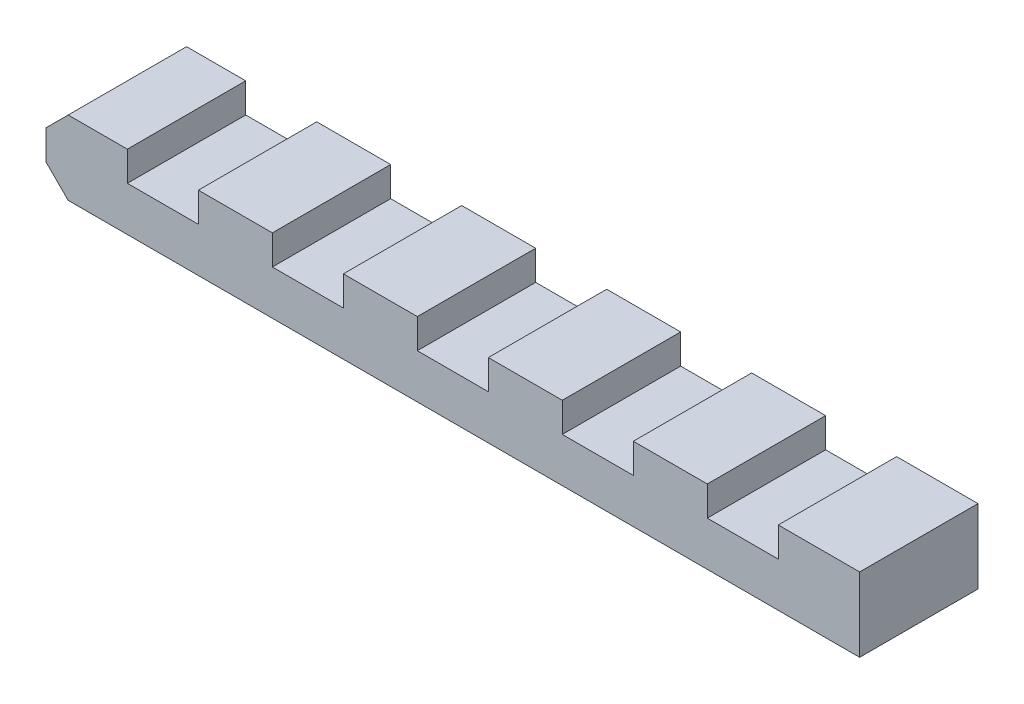
ISO-10303-21;
HEADER;
FILE_DESCRIPTION(('STEP AP214'),'2;1');
FILE_NAME('part.step','',(''),(''),'','','');
FILE_SCHEMA(('AUTOMOTIVE_DESIGN { 1 0 10303 214 1 1 1 1 }'));
ENDSEC;
DATA;
#1=APPLICATION_CONTEXT('core data for automotive mechanical design processes');
#2=APPLICATION_PROTOCOL_DEFINITION('international standard','automotive_design',2000,#1);
#3=PRODUCT_CONTEXT('',#1,'mechanical');
#4=PRODUCT('Part','Part','',(#3));
#5=PRODUCT_RELATED_PRODUCT_CATEGORY('part','',(#4));
#6=PRODUCT_DEFINITION_FORMATION('','',#4);
#7=PRODUCT_DEFINITION_CONTEXT('part definition',#1,'design');
#8=PRODUCT_DEFINITION('design','',#6,#7);
#9=PRODUCT_DEFINITION_SHAPE('','',#8);
#10=(LENGTH_UNIT() NAMED_UNIT(*) SI_UNIT(.MILLI.,.METRE.));
#11=(NAMED_UNIT(*) PLANE_ANGLE_UNIT() SI_UNIT($,.RADIAN.));
#12=(NAMED_UNIT(*) SI_UNIT($,.STERADIAN.) SOLID_ANGLE_UNIT());
#13=UNCERTAINTY_MEASURE_WITH_UNIT(LENGTH_MEASURE(1.E-05),#10,'distance_accuracy_value','');
#14=(GEOMETRIC_REPRESENTATION_CONTEXT(3) GLOBAL_UNCERTAINTY_ASSIGNED_CONTEXT((#13)) GLOBAL_UNIT_ASSIGNED_CONTEXT((#10,
#11,#12)) REPRESENTATION_CONTEXT('',''));
#15=CARTESIAN_POINT('',(0.,0.,0.));
#16=DIRECTION('',(0.,0.,1.));
#17=DIRECTION('',(1.,0.,0.));
#18=AXIS2_PLACEMENT_3D('',#15,#16,#17);
#19=CARTESIAN_POINT('',(0.,5.,0.));
#20=DIRECTION('',(0.,-1.,0.));
#21=DIRECTION('',(0.,0.,-1.));
#22=AXIS2_PLACEMENT_3D('',#19,#20,#21);
#23=PLANE('',#22);
#24=DIRECTION('',(-1.,0.,0.));
#25=VECTOR('',#24,1.);
#26=CARTESIAN_POINT('',(-27.5,5.,-4.));
#27=LINE('',#26,#25);
#28=CARTESIAN_POINT('',(-22.,5.,-4.));
#29=VERTEX_POINT('',#28);
#30=CARTESIAN_POINT('',(-26.,5.,-4.));
#31=VERTEX_POINT('',#30);
#32=EDGE_CURVE('E245',#29,#31,#27,.T.);
#33=ORIENTED_EDGE('',*,*,#32,.T.);
#34=DIRECTION('',(0.,0.,1.));
#35=VECTOR('',#34,1.);
#36=CARTESIAN_POINT('',(-26.,5.,0.));
#37=LINE('',#36,#35);
#38=CARTESIAN_POINT('',(-26.,5.,4.));
#39=VERTEX_POINT('',#38);
#40=EDGE_CURVE('E11',#31,#39,#37,.T.);
#41=ORIENTED_EDGE('',*,*,#40,.T.);
#42=DIRECTION('',(1.,0.,0.));
#43=VECTOR('',#42,1.);
#44=CARTESIAN_POINT('',(-27.5,5.,4.));
#45=LINE('',#44,#43);
#46=CARTESIAN_POINT('',(-22.,5.,4.));
#47=VERTEX_POINT('',#46);
#48=EDGE_CURVE('E424',#39,#47,#45,.T.);
#49=ORIENTED_EDGE('',*,*,#48,.T.);
#50=DIRECTION('',(0.,0.,1.));
#51=VECTOR('',#50,1.);
#52=CARTESIAN_POINT('',(-22.,5.,-4.));
#53=LINE('',#52,#51);
#54=EDGE_CURVE('E260',#29,#47,#53,.T.);
#55=ORIENTED_EDGE('',*,*,#54,.F.);
#56=EDGE_LOOP('',(#33,#41,#49,#55));
#57=FACE_BOUND('',#56,.T.);
#58=ADVANCED_FACE('F44',(#57),#23,.F.);
#59=CARTESIAN_POINT('',(-2.4,5.,-4.));
#60=VERTEX_POINT('',#59);
#61=CARTESIAN_POINT('',(-7.4,5.,-4.));
#62=VERTEX_POINT('',#61);
#63=EDGE_CURVE('E526',#60,#62,#27,.T.);
#64=ORIENTED_EDGE('',*,*,#63,.T.);
#65=DIRECTION('',(0.,0.,1.));
#66=VECTOR('',#65,1.);
#67=CARTESIAN_POINT('',(-7.4,5.,-4.));
#68=LINE('',#67,#66);
#69=CARTESIAN_POINT('',(-7.4,5.,4.));
#70=VERTEX_POINT('',#69);
#71=EDGE_CURVE('E280',#62,#70,#68,.T.);
#72=ORIENTED_EDGE('',*,*,#71,.T.);
#73=CARTESIAN_POINT('',(-2.4,5.,4.));
#74=VERTEX_POINT('',#73);
#75=EDGE_CURVE('E500',#70,#74,#45,.T.);
#76=ORIENTED_EDGE('',*,*,#75,.T.);
#77=DIRECTION('',(0.,0.,1.));
#78=VECTOR('',#77,1.);
#79=CARTESIAN_POINT('',(-2.4,5.,-4.));
#80=LINE('',#79,#78);
#81=EDGE_CURVE('E306',#60,#74,#80,.T.);
#82=ORIENTED_EDGE('',*,*,#81,.F.);
#83=EDGE_LOOP('',(#64,#72,#76,#82));
#84=FACE_BOUND('',#83,.T.);
#85=ADVANCED_FACE('F540',(#84),#23,.F.);
#86=CARTESIAN_POINT('',(7.4,5.,-4.));
#87=VERTEX_POINT('',#86);
#88=CARTESIAN_POINT('',(2.4,5.,-4.));
#89=VERTEX_POINT('',#88);
#90=EDGE_CURVE('E530',#87,#89,#27,.T.);
#91=ORIENTED_EDGE('',*,*,#90,.T.);
#92=DIRECTION('',(0.,0.,1.));
#93=VECTOR('',#92,1.);
#94=CARTESIAN_POINT('',(2.4,5.,-4.));
#95=LINE('',#94,#93);
#96=CARTESIAN_POINT('',(2.4,5.,4.));
#97=VERTEX_POINT('',#96);
#98=EDGE_CURVE('E316',#89,#97,#95,.T.);
#99=ORIENTED_EDGE('',*,*,#98,.T.);
#100=CARTESIAN_POINT('',(7.4,5.,4.));
#101=VERTEX_POINT('',#100);
#102=EDGE_CURVE('E494',#97,#101,#45,.T.);
#103=ORIENTED_EDGE('',*,*,#102,.T.);
#104=DIRECTION('',(0.,0.,1.));
#105=VECTOR('',#104,1.);
#106=CARTESIAN_POINT('',(7.4,5.,-4.));
#107=LINE('',#106,#105);
#108=EDGE_CURVE('E342',#87,#101,#107,.T.);
#109=ORIENTED_EDGE('',*,*,#108,.F.);
#110=EDGE_LOOP('',(#91,#99,#103,#109));
#111=FACE_BOUND('',#110,.T.);
#112=ADVANCED_FACE('F547',(#111),#23,.F.);
#113=CARTESIAN_POINT('',(17.2,5.,-4.));
#114=VERTEX_POINT('',#113);
#115=CARTESIAN_POINT('',(12.2,5.,-4.));
#116=VERTEX_POINT('',#115);
#117=EDGE_CURVE('E423',#114,#116,#27,.T.);
#118=ORIENTED_EDGE('',*,*,#117,.T.);
#119=DIRECTION('',(0.,0.,1.));
#120=VECTOR('',#119,1.);
#121=CARTESIAN_POINT('',(12.2,5.,-4.));
#122=LINE('',#121,#120);
#123=CARTESIAN_POINT('',(12.2,5.,4.));
#124=VERTEX_POINT('',#123);
#125=EDGE_CURVE('E352',#116,#124,#122,.T.);
#126=ORIENTED_EDGE('',*,*,#125,.T.);
#127=CARTESIAN_POINT('',(17.2,5.,4.));
#128=VERTEX_POINT('',#127);
#129=EDGE_CURVE('E491',#124,#128,#45,.T.);
#130=ORIENTED_EDGE('',*,*,#129,.T.);
#131=DIRECTION('',(0.,0.,1.));
#132=VECTOR('',#131,1.);
#133=CARTESIAN_POINT('',(17.2,5.,-4.));
#134=LINE('',#133,#132);
#135=EDGE_CURVE('E378',#114,#128,#134,.T.);
#136=ORIENTED_EDGE('',*,*,#135,.F.);
#137=EDGE_LOOP('',(#118,#126,#130,#136));
#138=FACE_BOUND('',#137,.T.);
#139=ADVANCED_FACE('F560',(#138),#23,.F.);
#140=CARTESIAN_POINT('',(27.5,5.,-4.));
#141=VERTEX_POINT('',#140);
#142=CARTESIAN_POINT('',(22.,5.,-4.));
#143=VERTEX_POINT('',#142);
#144=EDGE_CURVE('E418',#141,#143,#27,.T.);
#145=ORIENTED_EDGE('',*,*,#144,.T.);
#146=DIRECTION('',(0.,0.,1.));
#147=VECTOR('',#146,1.);
#148=CARTESIAN_POINT('',(22.,5.,-4.));
#149=LINE('',#148,#147);
#150=CARTESIAN_POINT('',(22.,5.,4.));
#151=VERTEX_POINT('',#150);
#152=EDGE_CURVE('E388',#143,#151,#149,.T.);
#153=ORIENTED_EDGE('',*,*,#152,.T.);
#154=CARTESIAN_POINT('',(27.5,5.,4.));
#155=VERTEX_POINT('',#154);
#156=EDGE_CURVE('E422',#151,#155,#45,.T.);
#157=ORIENTED_EDGE('',*,*,#156,.T.);
#158=DIRECTION('',(0.,0.,-1.));
#159=VECTOR('',#158,1.);
#160=CARTESIAN_POINT('',(27.5,5.,4.));
#161=LINE('',#160,#159);
#162=EDGE_CURVE('E413',#155,#141,#161,.T.);
#163=ORIENTED_EDGE('',*,*,#162,.T.);
#164=EDGE_LOOP('',(#145,#153,#157,#163));
#165=FACE_BOUND('',#164,.T.);
#166=ADVANCED_FACE('F551',(#165),#23,.F.);
#167=CARTESIAN_POINT('',(27.5,5.,4.));
#168=DIRECTION('',(-1.,0.,0.));
#169=DIRECTION('',(0.,0.,1.));
#170=AXIS2_PLACEMENT_3D('',#167,#168,#169);
#171=PLANE('',#170);
#172=DIRECTION('',(0.,0.,-1.));
#173=VECTOR('',#172,1.);
#174=CARTESIAN_POINT('',(27.5,0.,4.));
#175=LINE('',#174,#173);
#176=CARTESIAN_POINT('',(27.5,0.,4.));
#177=VERTEX_POINT('',#176);
#178=CARTESIAN_POINT('',(27.5,0.,-4.));
#179=VERTEX_POINT('',#178);
#180=EDGE_CURVE('E263',#177,#179,#175,.T.);
#181=ORIENTED_EDGE('',*,*,#180,.T.);
#182=DIRECTION('',(0.,-1.,0.));
#183=VECTOR('',#182,1.);
#184=CARTESIAN_POINT('',(27.5,5.,-4.));
#185=LINE('',#184,#183);
#186=EDGE_CURVE('E448',#141,#179,#185,.T.);
#187=ORIENTED_EDGE('',*,*,#186,.F.);
#188=ORIENTED_EDGE('',*,*,#162,.F.);
#189=DIRECTION('',(0.,-1.,0.));
#190=VECTOR('',#189,1.);
#191=CARTESIAN_POINT('',(27.5,5.,4.));
#192=LINE('',#191,#190);
#193=EDGE_CURVE('E427',#155,#177,#192,.T.);
#194=ORIENTED_EDGE('',*,*,#193,.T.);
#195=EDGE_LOOP('',(#181,#187,#188,#194));
#196=FACE_BOUND('',#195,.T.);
#197=ADVANCED_FACE('F484',(#196),#171,.F.);
#198=CARTESIAN_POINT('',(-27.5,5.,-4.));
#199=DIRECTION('',(0.,0.,1.));
#200=DIRECTION('',(1.,0.,0.));
#201=AXIS2_PLACEMENT_3D('',#198,#199,#200);
#202=PLANE('',#201);
#203=DIRECTION('',(-1.,0.,0.));
#204=VECTOR('',#203,1.);
#205=CARTESIAN_POINT('',(-27.5,0.,-4.));
#206=LINE('',#205,#204);
#207=CARTESIAN_POINT('',(-26.,0.,-4.));
#208=VERTEX_POINT('',#207);
#209=EDGE_CURVE('E432',#179,#208,#206,.T.);
#210=ORIENTED_EDGE('',*,*,#209,.T.);
#211=DIRECTION('',(-0.707106781186549,0.707106781186546,0.));
#212=VECTOR('',#211,1.);
#213=CARTESIAN_POINT('',(-27.5,1.50000000000001,-4.));
#214=LINE('',#213,#212);
#215=CARTESIAN_POINT('',(-27.5,1.50000000000001,-4.));
#216=VERTEX_POINT('',#215);
#217=EDGE_CURVE('E54',#208,#216,#214,.T.);
#218=ORIENTED_EDGE('',*,*,#217,.T.);
#219=DIRECTION('',(0.,-1.,0.));
#220=VECTOR('',#219,1.);
#221=CARTESIAN_POINT('',(-27.5,5.,-4.));
#222=LINE('',#221,#220);
#223=CARTESIAN_POINT('',(-27.5,3.49999999999999,-4.));
#224=VERTEX_POINT('',#223);
#225=EDGE_CURVE('E444',#224,#216,#222,.T.);
#226=ORIENTED_EDGE('',*,*,#225,.F.);
#227=DIRECTION('',(-0.707106781186544,-0.707106781186551,0.));
#228=VECTOR('',#227,1.);
#229=CARTESIAN_POINT('',(-26.,5.,-4.));
#230=LINE('',#229,#228);
#231=EDGE_CURVE('E61',#224,#31,#230,.F.);
#232=ORIENTED_EDGE('',*,*,#231,.T.);
#233=ORIENTED_EDGE('',*,*,#32,.F.);
#234=DIRECTION('',(0.,-1.,0.));
#235=VECTOR('',#234,1.);
#236=CARTESIAN_POINT('',(-22.,5.,-4.));
#237=LINE('',#236,#235);
#238=CARTESIAN_POINT('',(-22.,3.,-4.));
#239=VERTEX_POINT('',#238);
#240=EDGE_CURVE('E226',#29,#239,#237,.T.);
#241=ORIENTED_EDGE('',*,*,#240,.T.);
#242=DIRECTION('',(1.,0.,0.));
#243=VECTOR('',#242,1.);
#244=CARTESIAN_POINT('',(-22.,3.,-4.));
#245=LINE('',#244,#243);
#246=CARTESIAN_POINT('',(-17.2,3.,-4.));
#247=VERTEX_POINT('',#246);
#248=EDGE_CURVE('E238',#239,#247,#245,.T.);
#249=ORIENTED_EDGE('',*,*,#248,.T.);
#250=DIRECTION('',(0.,1.,0.));
#251=VECTOR('',#250,1.);
#252=CARTESIAN_POINT('',(-17.2,5.,-4.));
#253=LINE('',#252,#251);
#254=CARTESIAN_POINT('',(-17.2,5.,-4.));
#255=VERTEX_POINT('',#254);
#256=EDGE_CURVE('E235',#247,#255,#253,.T.);
#257=ORIENTED_EDGE('',*,*,#256,.T.);
#258=CARTESIAN_POINT('',(-12.2,5.,-4.));
#259=VERTEX_POINT('',#258);
#260=EDGE_CURVE('E524',#259,#255,#27,.T.);
#261=ORIENTED_EDGE('',*,*,#260,.F.);
#262=DIRECTION('',(0.,-1.,0.));
#263=VECTOR('',#262,1.);
#264=CARTESIAN_POINT('',(-12.2,5.,-4.));
#265=LINE('',#264,#263);
#266=CARTESIAN_POINT('',(-12.2,3.,-4.));
#267=VERTEX_POINT('',#266);
#268=EDGE_CURVE('E289',#259,#267,#265,.T.);
#269=ORIENTED_EDGE('',*,*,#268,.T.);
#270=DIRECTION('',(1.,0.,0.));
#271=VECTOR('',#270,1.);
#272=CARTESIAN_POINT('',(-12.2,3.,-4.));
#273=LINE('',#272,#271);
#274=CARTESIAN_POINT('',(-7.4,3.,-4.));
#275=VERTEX_POINT('',#274);
#276=EDGE_CURVE('E299',#267,#275,#273,.T.);
#277=ORIENTED_EDGE('',*,*,#276,.T.);
#278=DIRECTION('',(0.,1.,0.));
#279=VECTOR('',#278,1.);
#280=CARTESIAN_POINT('',(-7.4,5.,-4.));
#281=LINE('',#280,#279);
#282=EDGE_CURVE('E273',#275,#62,#281,.T.);
#283=ORIENTED_EDGE('',*,*,#282,.T.);
#284=ORIENTED_EDGE('',*,*,#63,.F.);
#285=DIRECTION('',(0.,-1.,0.));
#286=VECTOR('',#285,1.);
#287=CARTESIAN_POINT('',(-2.4,5.,-4.));
#288=LINE('',#287,#286);
#289=CARTESIAN_POINT('',(-2.4,3.,-4.));
#290=VERTEX_POINT('',#289);
#291=EDGE_CURVE('E325',#60,#290,#288,.T.);
#292=ORIENTED_EDGE('',*,*,#291,.T.);
#293=DIRECTION('',(1.,0.,0.));
#294=VECTOR('',#293,1.);
#295=CARTESIAN_POINT('',(-2.4,3.,-4.));
#296=LINE('',#295,#294);
#297=CARTESIAN_POINT('',(2.4,3.,-4.));
#298=VERTEX_POINT('',#297);
#299=EDGE_CURVE('E335',#290,#298,#296,.T.);
#300=ORIENTED_EDGE('',*,*,#299,.T.);
#301=DIRECTION('',(0.,1.,0.));
#302=VECTOR('',#301,1.);
#303=CARTESIAN_POINT('',(2.4,5.,-4.));
#304=LINE('',#303,#302);
#305=EDGE_CURVE('E309',#298,#89,#304,.T.);
#306=ORIENTED_EDGE('',*,*,#305,.T.);
#307=ORIENTED_EDGE('',*,*,#90,.F.);
#308=DIRECTION('',(0.,-1.,0.));
#309=VECTOR('',#308,1.);
#310=CARTESIAN_POINT('',(7.4,5.,-4.));
#311=LINE('',#310,#309);
#312=CARTESIAN_POINT('',(7.4,3.,-4.));
#313=VERTEX_POINT('',#312);
#314=EDGE_CURVE('E361',#87,#313,#311,.T.);
#315=ORIENTED_EDGE('',*,*,#314,.T.);
#316=DIRECTION('',(1.,0.,0.));
#317=VECTOR('',#316,1.);
#318=CARTESIAN_POINT('',(7.4,3.,-4.));
#319=LINE('',#318,#317);
#320=CARTESIAN_POINT('',(12.2,3.,-4.));
#321=VERTEX_POINT('',#320);
#322=EDGE_CURVE('E371',#313,#321,#319,.T.);
#323=ORIENTED_EDGE('',*,*,#322,.T.);
#324=DIRECTION('',(0.,1.,0.));
#325=VECTOR('',#324,1.);
#326=CARTESIAN_POINT('',(12.2,5.,-4.));
#327=LINE('',#326,#325);
#328=EDGE_CURVE('E345',#321,#116,#327,.T.);
#329=ORIENTED_EDGE('',*,*,#328,.T.);
#330=ORIENTED_EDGE('',*,*,#117,.F.);
#331=DIRECTION('',(0.,-1.,0.));
#332=VECTOR('',#331,1.);
#333=CARTESIAN_POINT('',(17.2,5.,-4.));
#334=LINE('',#333,#332);
#335=CARTESIAN_POINT('',(17.2,3.,-4.));
#336=VERTEX_POINT('',#335);
#337=EDGE_CURVE('E396',#114,#336,#334,.T.);
#338=ORIENTED_EDGE('',*,*,#337,.T.);
#339=DIRECTION('',(1.,0.,0.));
#340=VECTOR('',#339,1.);
#341=CARTESIAN_POINT('',(17.2,3.,-4.));
#342=LINE('',#341,#340);
#343=CARTESIAN_POINT('',(22.,3.,-4.));
#344=VERTEX_POINT('',#343);
#345=EDGE_CURVE('E406',#336,#344,#342,.T.);
#346=ORIENTED_EDGE('',*,*,#345,.T.);
#347=DIRECTION('',(0.,1.,0.));
#348=VECTOR('',#347,1.);
#349=CARTESIAN_POINT('',(22.,5.,-4.));
#350=LINE('',#349,#348);
#351=EDGE_CURVE('E381',#344,#143,#350,.T.);
#352=ORIENTED_EDGE('',*,*,#351,.T.);
#353=ORIENTED_EDGE('',*,*,#144,.F.);
#354=ORIENTED_EDGE('',*,*,#186,.T.);
#355=EDGE_LOOP('',(#210,#218,#226,#232,#233,#241,#249,#257,#261,#269,#277,#283,#284,#292,#300,
#306,#307,#315,#323,#329,#330,#338,#346,#352,#353,#354));
#356=FACE_BOUND('',#355,.T.);
#357=ADVANCED_FACE('F244',(#356),#202,.F.);
#358=CARTESIAN_POINT('',(-27.5,5.,4.));
#359=DIRECTION('',(1.,0.,0.));
#360=DIRECTION('',(0.,0.,-1.));
#361=AXIS2_PLACEMENT_3D('',#358,#359,#360);
#362=PLANE('',#361);
#363=ORIENTED_EDGE('',*,*,#225,.T.);
#364=DIRECTION('',(0.,0.,1.));
#365=VECTOR('',#364,1.);
#366=CARTESIAN_POINT('',(-27.5,1.50000000000001,4.));
#367=LINE('',#366,#365);
#368=CARTESIAN_POINT('',(-27.5,1.50000000000001,4.));
#369=VERTEX_POINT('',#368);
#370=EDGE_CURVE('E455',#216,#369,#367,.T.);
#371=ORIENTED_EDGE('',*,*,#370,.T.);
#372=DIRECTION('',(0.,-1.,0.));
#373=VECTOR('',#372,1.);
#374=CARTESIAN_POINT('',(-27.5,5.,4.));
#375=LINE('',#374,#373);
#376=CARTESIAN_POINT('',(-27.5,3.49999999999999,4.));
#377=VERTEX_POINT('',#376);
#378=EDGE_CURVE('E440',#377,#369,#375,.T.);
#379=ORIENTED_EDGE('',*,*,#378,.F.);
#380=DIRECTION('',(0.,0.,-1.));
#381=VECTOR('',#380,1.);
#382=CARTESIAN_POINT('',(-27.5,3.49999999999999,4.));
#383=LINE('',#382,#381);
#384=EDGE_CURVE('E452',#377,#224,#383,.T.);
#385=ORIENTED_EDGE('',*,*,#384,.T.);
#386=EDGE_LOOP('',(#363,#371,#379,#385));
#387=FACE_BOUND('',#386,.T.);
#388=ADVANCED_FACE('F473',(#387),#362,.F.);
#389=CARTESIAN_POINT('',(-27.5,5.,4.));
#390=DIRECTION('',(0.,0.,-1.));
#391=DIRECTION('',(-1.,0.,0.));
#392=AXIS2_PLACEMENT_3D('',#389,#390,#391);
#393=PLANE('',#392);
#394=ORIENTED_EDGE('',*,*,#378,.T.);
#395=DIRECTION('',(0.707106781186549,-0.707106781186546,0.));
#396=VECTOR('',#395,1.);
#397=CARTESIAN_POINT('',(-27.5,1.50000000000001,4.));
#398=LINE('',#397,#396);
#399=CARTESIAN_POINT('',(-26.,0.,4.));
#400=VERTEX_POINT('',#399);
#401=EDGE_CURVE('E462',#369,#400,#398,.T.);
#402=ORIENTED_EDGE('',*,*,#401,.T.);
#403=DIRECTION('',(1.,0.,0.));
#404=VECTOR('',#403,1.);
#405=CARTESIAN_POINT('',(-27.5,0.,4.));
#406=LINE('',#405,#404);
#407=EDGE_CURVE('E417',#400,#177,#406,.T.);
#408=ORIENTED_EDGE('',*,*,#407,.T.);
#409=ORIENTED_EDGE('',*,*,#193,.F.);
#410=ORIENTED_EDGE('',*,*,#156,.F.);
#411=DIRECTION('',(0.,1.,0.));
#412=VECTOR('',#411,1.);
#413=CARTESIAN_POINT('',(22.,5.,4.));
#414=LINE('',#413,#412);
#415=CARTESIAN_POINT('',(22.,3.,4.));
#416=VERTEX_POINT('',#415);
#417=EDGE_CURVE('E392',#416,#151,#414,.T.);
#418=ORIENTED_EDGE('',*,*,#417,.F.);
#419=DIRECTION('',(1.,0.,0.));
#420=VECTOR('',#419,1.);
#421=CARTESIAN_POINT('',(17.2,3.,4.));
#422=LINE('',#421,#420);
#423=CARTESIAN_POINT('',(17.2,3.,4.));
#424=VERTEX_POINT('',#423);
#425=EDGE_CURVE('E395',#424,#416,#422,.T.);
#426=ORIENTED_EDGE('',*,*,#425,.F.);
#427=DIRECTION('',(0.,-1.,0.));
#428=VECTOR('',#427,1.);
#429=CARTESIAN_POINT('',(17.2,5.,4.));
#430=LINE('',#429,#428);
#431=EDGE_CURVE('E356',#128,#424,#430,.T.);
#432=ORIENTED_EDGE('',*,*,#431,.F.);
#433=ORIENTED_EDGE('',*,*,#129,.F.);
#434=DIRECTION('',(0.,1.,0.));
#435=VECTOR('',#434,1.);
#436=CARTESIAN_POINT('',(12.2,5.,4.));
#437=LINE('',#436,#435);
#438=CARTESIAN_POINT('',(12.2,3.,4.));
#439=VERTEX_POINT('',#438);
#440=EDGE_CURVE('E357',#439,#124,#437,.T.);
#441=ORIENTED_EDGE('',*,*,#440,.F.);
#442=DIRECTION('',(1.,0.,0.));
#443=VECTOR('',#442,1.);
#444=CARTESIAN_POINT('',(7.4,3.,4.));
#445=LINE('',#444,#443);
#446=CARTESIAN_POINT('',(7.4,3.,4.));
#447=VERTEX_POINT('',#446);
#448=EDGE_CURVE('E360',#447,#439,#445,.T.);
#449=ORIENTED_EDGE('',*,*,#448,.F.);
#450=DIRECTION('',(0.,-1.,0.));
#451=VECTOR('',#450,1.);
#452=CARTESIAN_POINT('',(7.4,5.,4.));
#453=LINE('',#452,#451);
#454=EDGE_CURVE('E320',#101,#447,#453,.T.);
#455=ORIENTED_EDGE('',*,*,#454,.F.);
#456=ORIENTED_EDGE('',*,*,#102,.F.);
#457=DIRECTION('',(0.,1.,0.));
#458=VECTOR('',#457,1.);
#459=CARTESIAN_POINT('',(2.4,5.,4.));
#460=LINE('',#459,#458);
#461=CARTESIAN_POINT('',(2.4,3.,4.));
#462=VERTEX_POINT('',#461);
#463=EDGE_CURVE('E321',#462,#97,#460,.T.);
#464=ORIENTED_EDGE('',*,*,#463,.F.);
#465=DIRECTION('',(1.,0.,0.));
#466=VECTOR('',#465,1.);
#467=CARTESIAN_POINT('',(-2.4,3.,4.));
#468=LINE('',#467,#466);
#469=CARTESIAN_POINT('',(-2.4,3.,4.));
#470=VERTEX_POINT('',#469);
#471=EDGE_CURVE('E324',#470,#462,#468,.T.);
#472=ORIENTED_EDGE('',*,*,#471,.F.);
#473=DIRECTION('',(0.,-1.,0.));
#474=VECTOR('',#473,1.);
#475=CARTESIAN_POINT('',(-2.4,5.,4.));
#476=LINE('',#475,#474);
#477=EDGE_CURVE('E284',#74,#470,#476,.T.);
#478=ORIENTED_EDGE('',*,*,#477,.F.);
#479=ORIENTED_EDGE('',*,*,#75,.F.);
#480=DIRECTION('',(0.,1.,0.));
#481=VECTOR('',#480,1.);
#482=CARTESIAN_POINT('',(-7.4,5.,4.));
#483=LINE('',#482,#481);
#484=CARTESIAN_POINT('',(-7.4,3.,4.));
#485=VERTEX_POINT('',#484);
#486=EDGE_CURVE('E285',#485,#70,#483,.T.);
#487=ORIENTED_EDGE('',*,*,#486,.F.);
#488=DIRECTION('',(1.,0.,0.));
#489=VECTOR('',#488,1.);
#490=CARTESIAN_POINT('',(-12.2,3.,4.));
#491=LINE('',#490,#489);
#492=CARTESIAN_POINT('',(-12.2,3.,4.));
#493=VERTEX_POINT('',#492);
#494=EDGE_CURVE('E288',#493,#485,#491,.T.);
#495=ORIENTED_EDGE('',*,*,#494,.F.);
#496=DIRECTION('',(0.,-1.,0.));
#497=VECTOR('',#496,1.);
#498=CARTESIAN_POINT('',(-12.2,5.,4.));
#499=LINE('',#498,#497);
#500=CARTESIAN_POINT('',(-12.2,5.,4.));
#501=VERTEX_POINT('',#500);
#502=EDGE_CURVE('E257',#501,#493,#499,.T.);
#503=ORIENTED_EDGE('',*,*,#502,.F.);
#504=CARTESIAN_POINT('',(-17.2,5.,4.));
#505=VERTEX_POINT('',#504);
#506=EDGE_CURVE('E428',#505,#501,#45,.T.);
#507=ORIENTED_EDGE('',*,*,#506,.F.);
#508=DIRECTION('',(0.,1.,0.));
#509=VECTOR('',#508,1.);
#510=CARTESIAN_POINT('',(-17.2,5.,4.));
#511=LINE('',#510,#509);
#512=CARTESIAN_POINT('',(-17.2,3.,4.));
#513=VERTEX_POINT('',#512);
#514=EDGE_CURVE('E247',#513,#505,#511,.T.);
#515=ORIENTED_EDGE('',*,*,#514,.F.);
#516=DIRECTION('',(1.,0.,0.));
#517=VECTOR('',#516,1.);
#518=CARTESIAN_POINT('',(-22.,3.,4.));
#519=LINE('',#518,#517);
#520=CARTESIAN_POINT('',(-22.,3.,4.));
#521=VERTEX_POINT('',#520);
#522=EDGE_CURVE('E250',#521,#513,#519,.T.);
#523=ORIENTED_EDGE('',*,*,#522,.F.);
#524=DIRECTION('',(0.,-1.,0.));
#525=VECTOR('',#524,1.);
#526=CARTESIAN_POINT('',(-22.,5.,4.));
#527=LINE('',#526,#525);
#528=EDGE_CURVE('E229',#47,#521,#527,.T.);
#529=ORIENTED_EDGE('',*,*,#528,.F.);
#530=ORIENTED_EDGE('',*,*,#48,.F.);
#531=DIRECTION('',(0.707106781186544,0.707106781186551,0.));
#532=VECTOR('',#531,1.);
#533=CARTESIAN_POINT('',(-26.,5.,4.));
#534=LINE('',#533,#532);
#535=EDGE_CURVE('E459',#39,#377,#534,.F.);
#536=ORIENTED_EDGE('',*,*,#535,.T.);
#537=EDGE_LOOP('',(#394,#402,#408,#409,#410,#418,#426,#432,#433,#441,#449,#455,#456,#464,#472,
#478,#479,#487,#495,#503,#507,#515,#523,#529,#530,#536));
#538=FACE_BOUND('',#537,.T.);
#539=ADVANCED_FACE('F478',(#538),#393,.F.);
#540=ORIENTED_EDGE('',*,*,#260,.T.);
#541=DIRECTION('',(0.,0.,1.));
#542=VECTOR('',#541,1.);
#543=CARTESIAN_POINT('',(-17.2,5.,-4.));
#544=LINE('',#543,#542);
#545=EDGE_CURVE('E264',#255,#505,#544,.T.);
#546=ORIENTED_EDGE('',*,*,#545,.T.);
#547=ORIENTED_EDGE('',*,*,#506,.T.);
#548=DIRECTION('',(0.,0.,1.));
#549=VECTOR('',#548,1.);
#550=CARTESIAN_POINT('',(-12.2,5.,-4.));
#551=LINE('',#550,#549);
#552=EDGE_CURVE('E270',#259,#501,#551,.T.);
#553=ORIENTED_EDGE('',*,*,#552,.F.);
#554=EDGE_LOOP('',(#540,#546,#547,#553));
#555=FACE_BOUND('',#554,.T.);
#556=ADVANCED_FACE('F515',(#555),#23,.F.);
#557=CARTESIAN_POINT('',(0.,0.,0.));
#558=DIRECTION('',(0.,-1.,0.));
#559=DIRECTION('',(0.,0.,-1.));
#560=AXIS2_PLACEMENT_3D('',#557,#558,#559);
#561=PLANE('',#560);
#562=ORIENTED_EDGE('',*,*,#407,.F.);
#563=DIRECTION('',(0.,0.,-1.));
#564=VECTOR('',#563,1.);
#565=CARTESIAN_POINT('',(-26.,0.,-4.));
#566=LINE('',#565,#564);
#567=EDGE_CURVE('E69',#400,#208,#566,.T.);
#568=ORIENTED_EDGE('',*,*,#567,.T.);
#569=ORIENTED_EDGE('',*,*,#209,.F.);
#570=ORIENTED_EDGE('',*,*,#180,.F.);
#571=EDGE_LOOP('',(#562,#568,#569,#570));
#572=FACE_BOUND('',#571,.T.);
#573=ADVANCED_FACE('F481',(#572),#561,.T.);
#574=CARTESIAN_POINT('',(22.,5.,-4.));
#575=DIRECTION('',(1.,0.,0.));
#576=DIRECTION('',(0.,0.,-1.));
#577=AXIS2_PLACEMENT_3D('',#574,#575,#576);
#578=PLANE('',#577);
#579=ORIENTED_EDGE('',*,*,#417,.T.);
#580=ORIENTED_EDGE('',*,*,#152,.F.);
#581=ORIENTED_EDGE('',*,*,#351,.F.);
#582=DIRECTION('',(0.,0.,1.));
#583=VECTOR('',#582,1.);
#584=CARTESIAN_POINT('',(22.,3.,-4.));
#585=LINE('',#584,#583);
#586=EDGE_CURVE('E385',#344,#416,#585,.T.);
#587=ORIENTED_EDGE('',*,*,#586,.T.);
#588=EDGE_LOOP('',(#579,#580,#581,#587));
#589=FACE_BOUND('',#588,.T.);
#590=ADVANCED_FACE('F557',(#589),#578,.F.);
#591=CARTESIAN_POINT('',(17.2,3.,-4.));
#592=DIRECTION('',(0.,-1.,0.));
#593=DIRECTION('',(0.,0.,-1.));
#594=AXIS2_PLACEMENT_3D('',#591,#592,#593);
#595=PLANE('',#594);
#596=ORIENTED_EDGE('',*,*,#425,.T.);
#597=ORIENTED_EDGE('',*,*,#586,.F.);
#598=ORIENTED_EDGE('',*,*,#345,.F.);
#599=DIRECTION('',(0.,0.,1.));
#600=VECTOR('',#599,1.);
#601=CARTESIAN_POINT('',(17.2,3.,-4.));
#602=LINE('',#601,#600);
#603=EDGE_CURVE('E382',#336,#424,#602,.T.);
#604=ORIENTED_EDGE('',*,*,#603,.T.);
#605=EDGE_LOOP('',(#596,#597,#598,#604));
#606=FACE_BOUND('',#605,.T.);
#607=ADVANCED_FACE('F570',(#606),#595,.F.);
#608=CARTESIAN_POINT('',(17.2,5.,-4.));
#609=DIRECTION('',(-1.,0.,0.));
#610=DIRECTION('',(0.,0.,1.));
#611=AXIS2_PLACEMENT_3D('',#608,#609,#610);
#612=PLANE('',#611);
#613=ORIENTED_EDGE('',*,*,#431,.T.);
#614=ORIENTED_EDGE('',*,*,#603,.F.);
#615=ORIENTED_EDGE('',*,*,#337,.F.);
#616=ORIENTED_EDGE('',*,*,#135,.T.);
#617=EDGE_LOOP('',(#613,#614,#615,#616));
#618=FACE_BOUND('',#617,.T.);
#619=ADVANCED_FACE('F574',(#618),#612,.F.);
#620=CARTESIAN_POINT('',(12.2,5.,-4.));
#621=DIRECTION('',(1.,0.,0.));
#622=DIRECTION('',(0.,0.,-1.));
#623=AXIS2_PLACEMENT_3D('',#620,#621,#622);
#624=PLANE('',#623);
#625=ORIENTED_EDGE('',*,*,#440,.T.);
#626=ORIENTED_EDGE('',*,*,#125,.F.);
#627=ORIENTED_EDGE('',*,*,#328,.F.);
#628=DIRECTION('',(0.,0.,1.));
#629=VECTOR('',#628,1.);
#630=CARTESIAN_POINT('',(12.2,3.,-4.));
#631=LINE('',#630,#629);
#632=EDGE_CURVE('E349',#321,#439,#631,.T.);
#633=ORIENTED_EDGE('',*,*,#632,.T.);
#634=EDGE_LOOP('',(#625,#626,#627,#633));
#635=FACE_BOUND('',#634,.T.);
#636=ADVANCED_FACE('F597',(#635),#624,.F.);
#637=CARTESIAN_POINT('',(7.4,3.,-4.));
#638=DIRECTION('',(0.,-1.,0.));
#639=DIRECTION('',(0.,0.,-1.));
#640=AXIS2_PLACEMENT_3D('',#637,#638,#639);
#641=PLANE('',#640);
#642=ORIENTED_EDGE('',*,*,#448,.T.);
#643=ORIENTED_EDGE('',*,*,#632,.F.);
#644=ORIENTED_EDGE('',*,*,#322,.F.);
#645=DIRECTION('',(0.,0.,1.));
#646=VECTOR('',#645,1.);
#647=CARTESIAN_POINT('',(7.4,3.,-4.));
#648=LINE('',#647,#646);
#649=EDGE_CURVE('E346',#313,#447,#648,.T.);
#650=ORIENTED_EDGE('',*,*,#649,.T.);
#651=EDGE_LOOP('',(#642,#643,#644,#650));
#652=FACE_BOUND('',#651,.T.);
#653=ADVANCED_FACE('F595',(#652),#641,.F.);
#654=CARTESIAN_POINT('',(7.4,5.,-4.));
#655=DIRECTION('',(-1.,0.,0.));
#656=DIRECTION('',(0.,0.,1.));
#657=AXIS2_PLACEMENT_3D('',#654,#655,#656);
#658=PLANE('',#657);
#659=ORIENTED_EDGE('',*,*,#454,.T.);
#660=ORIENTED_EDGE('',*,*,#649,.F.);
#661=ORIENTED_EDGE('',*,*,#314,.F.);
#662=ORIENTED_EDGE('',*,*,#108,.T.);
#663=EDGE_LOOP('',(#659,#660,#661,#662));
#664=FACE_BOUND('',#663,.T.);
#665=ADVANCED_FACE('F592',(#664),#658,.F.);
#666=CARTESIAN_POINT('',(2.4,5.,-4.));
#667=DIRECTION('',(1.,0.,0.));
#668=DIRECTION('',(0.,1.,0.));
#669=AXIS2_PLACEMENT_3D('',#666,#667,#668);
#670=PLANE('',#669);
#671=ORIENTED_EDGE('',*,*,#463,.T.);
#672=ORIENTED_EDGE('',*,*,#98,.F.);
#673=ORIENTED_EDGE('',*,*,#305,.F.);
#674=DIRECTION('',(0.,0.,1.));
#675=VECTOR('',#674,1.);
#676=CARTESIAN_POINT('',(2.4,3.,-4.));
#677=LINE('',#676,#675);
#678=EDGE_CURVE('E313',#298,#462,#677,.T.);
#679=ORIENTED_EDGE('',*,*,#678,.T.);
#680=EDGE_LOOP('',(#671,#672,#673,#679));
#681=FACE_BOUND('',#680,.T.);
#682=ADVANCED_FACE('F585',(#681),#670,.F.);
#683=CARTESIAN_POINT('',(-2.4,3.,-4.));
#684=DIRECTION('',(0.,-1.,0.));
#685=DIRECTION('',(0.,0.,-1.));
#686=AXIS2_PLACEMENT_3D('',#683,#684,#685);
#687=PLANE('',#686);
#688=ORIENTED_EDGE('',*,*,#471,.T.);
#689=ORIENTED_EDGE('',*,*,#678,.F.);
#690=ORIENTED_EDGE('',*,*,#299,.F.);
#691=DIRECTION('',(0.,0.,1.));
#692=VECTOR('',#691,1.);
#693=CARTESIAN_POINT('',(-2.4,3.,-4.));
#694=LINE('',#693,#692);
#695=EDGE_CURVE('E310',#290,#470,#694,.T.);
#696=ORIENTED_EDGE('',*,*,#695,.T.);
#697=EDGE_LOOP('',(#688,#689,#690,#696));
#698=FACE_BOUND('',#697,.T.);
#699=ADVANCED_FACE('F653',(#698),#687,.F.);
#700=CARTESIAN_POINT('',(-2.4,5.,-4.));
#701=DIRECTION('',(-1.,0.,0.));
#702=DIRECTION('',(0.,-1.,0.));
#703=AXIS2_PLACEMENT_3D('',#700,#701,#702);
#704=PLANE('',#703);
#705=ORIENTED_EDGE('',*,*,#477,.T.);
#706=ORIENTED_EDGE('',*,*,#695,.F.);
#707=ORIENTED_EDGE('',*,*,#291,.F.);
#708=ORIENTED_EDGE('',*,*,#81,.T.);
#709=EDGE_LOOP('',(#705,#706,#707,#708));
#710=FACE_BOUND('',#709,.T.);
#711=ADVANCED_FACE('F663',(#710),#704,.F.);
#712=CARTESIAN_POINT('',(-7.4,5.,-4.));
#713=DIRECTION('',(1.,0.,0.));
#714=DIRECTION('',(0.,0.,-1.));
#715=AXIS2_PLACEMENT_3D('',#712,#713,#714);
#716=PLANE('',#715);
#717=ORIENTED_EDGE('',*,*,#486,.T.);
#718=ORIENTED_EDGE('',*,*,#71,.F.);
#719=ORIENTED_EDGE('',*,*,#282,.F.);
#720=DIRECTION('',(0.,0.,1.));
#721=VECTOR('',#720,1.);
#722=CARTESIAN_POINT('',(-7.4,3.,-4.));
#723=LINE('',#722,#721);
#724=EDGE_CURVE('E277',#275,#485,#723,.T.);
#725=ORIENTED_EDGE('',*,*,#724,.T.);
#726=EDGE_LOOP('',(#717,#718,#719,#725));
#727=FACE_BOUND('',#726,.T.);
#728=ADVANCED_FACE('F674',(#727),#716,.F.);
#729=CARTESIAN_POINT('',(-12.2,3.,-4.));
#730=DIRECTION('',(0.,-1.,0.));
#731=DIRECTION('',(0.,0.,-1.));
#732=AXIS2_PLACEMENT_3D('',#729,#730,#731);
#733=PLANE('',#732);
#734=ORIENTED_EDGE('',*,*,#494,.T.);
#735=ORIENTED_EDGE('',*,*,#724,.F.);
#736=ORIENTED_EDGE('',*,*,#276,.F.);
#737=DIRECTION('',(0.,0.,1.));
#738=VECTOR('',#737,1.);
#739=CARTESIAN_POINT('',(-12.2,3.,-4.));
#740=LINE('',#739,#738);
#741=EDGE_CURVE('E274',#267,#493,#740,.T.);
#742=ORIENTED_EDGE('',*,*,#741,.T.);
#743=EDGE_LOOP('',(#734,#735,#736,#742));
#744=FACE_BOUND('',#743,.T.);
#745=ADVANCED_FACE('F685',(#744),#733,.F.);
#746=CARTESIAN_POINT('',(-12.2,5.,-4.));
#747=DIRECTION('',(-1.,0.,0.));
#748=DIRECTION('',(0.,0.,1.));
#749=AXIS2_PLACEMENT_3D('',#746,#747,#748);
#750=PLANE('',#749);
#751=ORIENTED_EDGE('',*,*,#502,.T.);
#752=ORIENTED_EDGE('',*,*,#741,.F.);
#753=ORIENTED_EDGE('',*,*,#268,.F.);
#754=ORIENTED_EDGE('',*,*,#552,.T.);
#755=EDGE_LOOP('',(#751,#752,#753,#754));
#756=FACE_BOUND('',#755,.T.);
#757=ADVANCED_FACE('F522',(#756),#750,.F.);
#758=CARTESIAN_POINT('',(-22.,5.,-4.));
#759=DIRECTION('',(-1.,0.,0.));
#760=DIRECTION('',(0.,0.,1.));
#761=AXIS2_PLACEMENT_3D('',#758,#759,#760);
#762=PLANE('',#761);
#763=ORIENTED_EDGE('',*,*,#528,.T.);
#764=DIRECTION('',(0.,0.,1.));
#765=VECTOR('',#764,1.);
#766=CARTESIAN_POINT('',(-22.,3.,-4.));
#767=LINE('',#766,#765);
#768=EDGE_CURVE('E221',#239,#521,#767,.T.);
#769=ORIENTED_EDGE('',*,*,#768,.F.);
#770=ORIENTED_EDGE('',*,*,#240,.F.);
#771=ORIENTED_EDGE('',*,*,#54,.T.);
#772=EDGE_LOOP('',(#763,#769,#770,#771));
#773=FACE_BOUND('',#772,.T.);
#774=ADVANCED_FACE('F223',(#773),#762,.F.);
#775=CARTESIAN_POINT('',(-17.2,5.,-4.));
#776=DIRECTION('',(1.,0.,0.));
#777=DIRECTION('',(0.,0.,-1.));
#778=AXIS2_PLACEMENT_3D('',#775,#776,#777);
#779=PLANE('',#778);
#780=ORIENTED_EDGE('',*,*,#514,.T.);
#781=ORIENTED_EDGE('',*,*,#545,.F.);
#782=ORIENTED_EDGE('',*,*,#256,.F.);
#783=DIRECTION('',(0.,0.,1.));
#784=VECTOR('',#783,1.);
#785=CARTESIAN_POINT('',(-17.2,3.,-4.));
#786=LINE('',#785,#784);
#787=EDGE_CURVE('E234',#247,#513,#786,.T.);
#788=ORIENTED_EDGE('',*,*,#787,.T.);
#789=EDGE_LOOP('',(#780,#781,#782,#788));
#790=FACE_BOUND('',#789,.T.);
#791=ADVANCED_FACE('F715',(#790),#779,.F.);
#792=CARTESIAN_POINT('',(-22.,3.,-4.));
#793=DIRECTION('',(0.,-1.,0.));
#794=DIRECTION('',(0.,0.,-1.));
#795=AXIS2_PLACEMENT_3D('',#792,#793,#794);
#796=PLANE('',#795);
#797=ORIENTED_EDGE('',*,*,#522,.T.);
#798=ORIENTED_EDGE('',*,*,#787,.F.);
#799=ORIENTED_EDGE('',*,*,#248,.F.);
#800=ORIENTED_EDGE('',*,*,#768,.T.);
#801=EDGE_LOOP('',(#797,#798,#799,#800));
#802=FACE_BOUND('',#801,.T.);
#803=ADVANCED_FACE('F239',(#802),#796,.F.);
#804=CARTESIAN_POINT('',(-27.5,1.50000000000001,4.));
#805=DIRECTION('',(-0.707106781186546,-0.707106781186549,0.));
#806=DIRECTION('',(0.,0.,-1.));
#807=AXIS2_PLACEMENT_3D('',#804,#805,#806);
#808=PLANE('',#807);
#809=ORIENTED_EDGE('',*,*,#217,.F.);
#810=ORIENTED_EDGE('',*,*,#567,.F.);
#811=ORIENTED_EDGE('',*,*,#401,.F.);
#812=ORIENTED_EDGE('',*,*,#370,.F.);
#813=EDGE_LOOP('',(#809,#810,#811,#812));
#814=FACE_BOUND('',#813,.T.);
#815=ADVANCED_FACE('F476',(#814),#808,.T.);
#816=CARTESIAN_POINT('',(-26.,5.,0.));
#817=DIRECTION('',(0.707106781186551,-0.707106781186544,0.));
#818=DIRECTION('',(0.,0.,1.));
#819=AXIS2_PLACEMENT_3D('',#816,#817,#818);
#820=PLANE('',#819);
#821=ORIENTED_EDGE('',*,*,#231,.F.);
#822=ORIENTED_EDGE('',*,*,#384,.F.);
#823=ORIENTED_EDGE('',*,*,#535,.F.);
#824=ORIENTED_EDGE('',*,*,#40,.F.);
#825=EDGE_LOOP('',(#821,#822,#823,#824));
#826=FACE_BOUND('',#825,.T.);
#827=ADVANCED_FACE('F47',(#826),#820,.F.);
#828=CLOSED_SHELL('',(#58,#85,#112,#139,#166,#197,#357,#388,#539,#556,#573,#590,#607,#619,#636,
#653,#665,#682,#699,#711,#728,#745,#757,#774,#791,#803,#815,#827));
#829=MANIFOLD_SOLID_BREP('B2',#828);
#830=ADVANCED_BREP_SHAPE_REPRESENTATION('',(#18,#829),#14);
#831=SHAPE_DEFINITION_REPRESENTATION(#9,#830);
ENDSEC;
END-ISO-10303-21;
